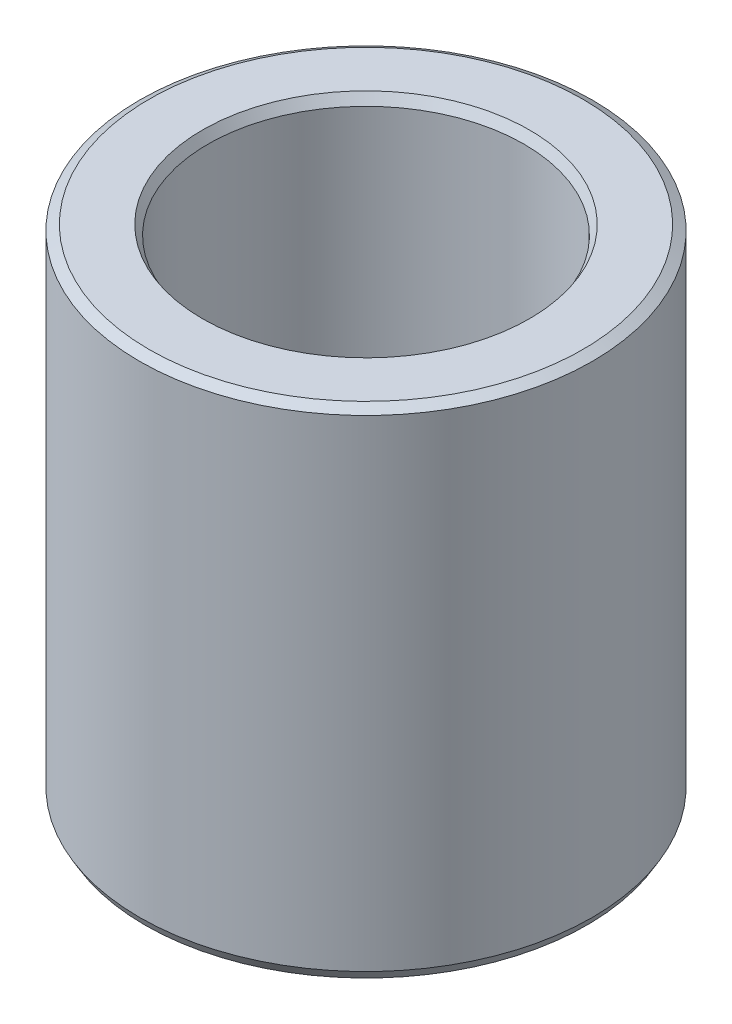
ISO-10303-21;
HEADER;
FILE_DESCRIPTION(('STEP AP214'),'2;1');
FILE_NAME('part.step','',(''),(''),'','','');
FILE_SCHEMA(('AUTOMOTIVE_DESIGN { 1 0 10303 214 1 1 1 1 }'));
ENDSEC;
DATA;
#1=APPLICATION_CONTEXT('core data for automotive mechanical design processes');
#2=APPLICATION_PROTOCOL_DEFINITION('international standard','automotive_design',2000,#1);
#3=PRODUCT_CONTEXT('',#1,'mechanical');
#4=PRODUCT('Part','Part','',(#3));
#5=PRODUCT_RELATED_PRODUCT_CATEGORY('part','',(#4));
#6=PRODUCT_DEFINITION_FORMATION('','',#4);
#7=PRODUCT_DEFINITION_CONTEXT('part definition',#1,'design');
#8=PRODUCT_DEFINITION('design','',#6,#7);
#9=PRODUCT_DEFINITION_SHAPE('','',#8);
#10=(LENGTH_UNIT() NAMED_UNIT(*) SI_UNIT(.MILLI.,.METRE.));
#11=(NAMED_UNIT(*) PLANE_ANGLE_UNIT() SI_UNIT($,.RADIAN.));
#12=(NAMED_UNIT(*) SI_UNIT($,.STERADIAN.) SOLID_ANGLE_UNIT());
#13=UNCERTAINTY_MEASURE_WITH_UNIT(LENGTH_MEASURE(1.E-05),#10,'distance_accuracy_value','');
#14=(GEOMETRIC_REPRESENTATION_CONTEXT(3) GLOBAL_UNCERTAINTY_ASSIGNED_CONTEXT((#13)) GLOBAL_UNIT_ASSIGNED_CONTEXT((#10,
#11,#12)) REPRESENTATION_CONTEXT('',''));
#15=CARTESIAN_POINT('',(0.,0.,0.));
#16=DIRECTION('',(0.,0.,1.));
#17=DIRECTION('',(1.,0.,0.));
#18=AXIS2_PLACEMENT_3D('',#15,#16,#17);
#19=CARTESIAN_POINT('',(0.,76.783560247809,0.));
#20=DIRECTION('',(0.,-1.,0.));
#21=DIRECTION('',(0.,0.,-1.));
#22=AXIS2_PLACEMENT_3D('',#19,#20,#21);
#23=CYLINDRICAL_SURFACE('',#22,35.);
#24=CARTESIAN_POINT('',(0.,1.47104861356911,0.));
#25=DIRECTION('',(0.,1.,0.));
#26=DIRECTION('',(0.,0.,1.));
#27=AXIS2_PLACEMENT_3D('',#24,#25,#26);
#28=CIRCLE('',#27,35.);
#29=CARTESIAN_POINT('',(0.,1.47104861356911,35.));
#30=VERTEX_POINT('',#29);
#31=EDGE_CURVE('E10',#30,#30,#28,.T.);
#32=ORIENTED_EDGE('',*,*,#31,.T.);
#33=EDGE_LOOP('',(#32));
#34=FACE_BOUND('',#33,.T.);
#35=CARTESIAN_POINT('',(0.,75.9342499347738,0.));
#36=DIRECTION('',(0.,1.,0.));
#37=DIRECTION('',(0.,0.,1.));
#38=AXIS2_PLACEMENT_3D('',#35,#36,#37);
#39=CIRCLE('',#38,35.);
#40=CARTESIAN_POINT('',(0.,75.9342499347738,-35.));
#41=VERTEX_POINT('',#40);
#42=EDGE_CURVE('E50',#41,#41,#39,.F.);
#43=ORIENTED_EDGE('',*,*,#42,.T.);
#44=EDGE_LOOP('',(#43));
#45=FACE_BOUND('',#44,.T.);
#46=ADVANCED_FACE('F39',(#34,#45),#23,.T.);
#47=CARTESIAN_POINT('',(0.,76.783560247809,0.));
#48=DIRECTION('',(0.,1.,0.));
#49=DIRECTION('',(0.,0.,1.));
#50=AXIS2_PLACEMENT_3D('',#47,#48,#49);
#51=PLANE('',#50);
#52=CARTESIAN_POINT('',(0.,76.783560247809,0.));
#53=DIRECTION('',(0.,1.,0.));
#54=DIRECTION('',(0.,0.,1.));
#55=AXIS2_PLACEMENT_3D('',#52,#53,#54);
#56=CIRCLE('',#55,25.2855158450938);
#57=CARTESIAN_POINT('',(0.,76.783560247809,25.2855158450938));
#58=VERTEX_POINT('',#57);
#59=EDGE_CURVE('E58',#58,#58,#56,.F.);
#60=ORIENTED_EDGE('',*,*,#59,.T.);
#61=EDGE_LOOP('',(#60));
#62=FACE_BOUND('',#61,.T.);
#63=CARTESIAN_POINT('',(0.,76.783560247809,0.));
#64=DIRECTION('',(0.,1.,0.));
#65=DIRECTION('',(0.,0.,1.));
#66=AXIS2_PLACEMENT_3D('',#63,#64,#65);
#67=CIRCLE('',#66,33.5289513864309);
#68=CARTESIAN_POINT('',(0.,76.7835602478089,-33.5289513864309));
#69=VERTEX_POINT('',#68);
#70=EDGE_CURVE('E61',#69,#69,#67,.T.);
#71=ORIENTED_EDGE('',*,*,#70,.T.);
#72=EDGE_LOOP('',(#71));
#73=FACE_BOUND('',#72,.T.);
#74=ADVANCED_FACE('F88',(#62,#73),#51,.T.);
#75=CARTESIAN_POINT('',(0.,0.,0.));
#76=DIRECTION('',(0.,1.,0.));
#77=DIRECTION('',(0.,0.,1.));
#78=AXIS2_PLACEMENT_3D('',#75,#76,#77);
#79=PLANE('',#78);
#80=CARTESIAN_POINT('',(0.,0.,0.));
#81=DIRECTION('',(0.,1.,0.));
#82=DIRECTION('',(0.,0.,1.));
#83=AXIS2_PLACEMENT_3D('',#80,#81,#82);
#84=CIRCLE('',#83,25.9072541456277);
#85=CARTESIAN_POINT('',(0.,0.,-25.9072541456277));
#86=VERTEX_POINT('',#85);
#87=EDGE_CURVE('E51',#86,#86,#84,.T.);
#88=ORIENTED_EDGE('',*,*,#87,.T.);
#89=EDGE_LOOP('',(#88));
#90=FACE_BOUND('',#89,.T.);
#91=CARTESIAN_POINT('',(0.,0.,0.));
#92=DIRECTION('',(0.,1.,0.));
#93=DIRECTION('',(0.,0.,1.));
#94=AXIS2_PLACEMENT_3D('',#91,#92,#93);
#95=CIRCLE('',#94,34.1506896869649);
#96=CARTESIAN_POINT('',(0.,0.,34.1506896869649));
#97=VERTEX_POINT('',#96);
#98=EDGE_CURVE('E54',#97,#97,#95,.F.);
#99=ORIENTED_EDGE('',*,*,#98,.T.);
#100=EDGE_LOOP('',(#99));
#101=FACE_BOUND('',#100,.T.);
#102=ADVANCED_FACE('F83',(#90,#101),#79,.F.);
#103=CARTESIAN_POINT('',(0.,76.783560247809,0.));
#104=DIRECTION('',(0.,-1.,0.));
#105=DIRECTION('',(0.,0.,-1.));
#106=AXIS2_PLACEMENT_3D('',#103,#104,#105);
#107=CYLINDRICAL_SURFACE('',#106,24.4362055320586);
#108=CARTESIAN_POINT('',(0.,75.3125116342398,0.));
#109=DIRECTION('',(0.,1.,0.));
#110=DIRECTION('',(0.,0.,1.));
#111=AXIS2_PLACEMENT_3D('',#108,#109,#110);
#112=CIRCLE('',#111,24.4362055320586);
#113=CARTESIAN_POINT('',(0.,75.3125116342398,24.4362055320586));
#114=VERTEX_POINT('',#113);
#115=EDGE_CURVE('E67',#114,#114,#112,.T.);
#116=ORIENTED_EDGE('',*,*,#115,.T.);
#117=EDGE_LOOP('',(#116));
#118=FACE_BOUND('',#117,.T.);
#119=CARTESIAN_POINT('',(0.,0.849310313035173,0.));
#120=DIRECTION('',(0.,1.,0.));
#121=DIRECTION('',(0.,0.,1.));
#122=AXIS2_PLACEMENT_3D('',#119,#120,#121);
#123=CIRCLE('',#122,24.4362055320586);
#124=CARTESIAN_POINT('',(0.,0.849310313035173,-24.4362055320586));
#125=VERTEX_POINT('',#124);
#126=EDGE_CURVE('E69',#125,#125,#123,.F.);
#127=ORIENTED_EDGE('',*,*,#126,.T.);
#128=EDGE_LOOP('',(#127));
#129=FACE_BOUND('',#128,.T.);
#130=ADVANCED_FACE('F71',(#118,#129),#107,.F.);
#131=CARTESIAN_POINT('',(0.,75.3125116342398,0.));
#132=DIRECTION('',(0.,1.,0.));
#133=DIRECTION('',(0.,0.,1.));
#134=AXIS2_PLACEMENT_3D('',#131,#132,#133);
#135=CONICAL_SURFACE('',#134,24.4362055320586,0.523598775598292);
#136=ORIENTED_EDGE('',*,*,#59,.F.);
#137=EDGE_LOOP('',(#136));
#138=FACE_BOUND('',#137,.T.);
#139=ORIENTED_EDGE('',*,*,#115,.F.);
#140=EDGE_LOOP('',(#139));
#141=FACE_BOUND('',#140,.T.);
#142=ADVANCED_FACE('F77',(#138,#141),#135,.F.);
#143=CARTESIAN_POINT('',(0.,0.,0.));
#144=DIRECTION('',(0.,-1.,0.));
#145=DIRECTION('',(0.,0.,-1.));
#146=AXIS2_PLACEMENT_3D('',#143,#144,#145);
#147=CONICAL_SURFACE('',#146,25.9072541456277,1.04719755119659);
#148=CARTESIAN_POINT('',(0.,0.849310313035173,-24.4362055320586));
#149=CARTESIAN_POINT('',(0.,0.840463330607724,-24.4515289551166));
#150=CARTESIAN_POINT('',(0.,0.831616348180274,-24.4668523781747));
#151=CARTESIAN_POINT('',(0.,0.813922383325374,-24.4974992242907));
#152=CARTESIAN_POINT('',(0.,0.805075400897924,-24.5128226473487));
#153=CARTESIAN_POINT('',(0.,0.787381436043025,-24.5434694934647));
#154=CARTESIAN_POINT('',(0.,0.778534453615575,-24.5587929165227));
#155=CARTESIAN_POINT('',(0.,0.760840488760676,-24.5894397626387));
#156=CARTESIAN_POINT('',(0.,0.751993506333226,-24.6047631856968));
#157=CARTESIAN_POINT('',(0.,0.734299541478326,-24.6354100318128));
#158=CARTESIAN_POINT('',(0.,0.725452559050877,-24.6507334548708));
#159=CARTESIAN_POINT('',(0.,0.707758594195978,-24.6813803009868));
#160=CARTESIAN_POINT('',(0.,0.698911611768528,-24.6967037240448));
#161=CARTESIAN_POINT('',(0.,0.681217646913628,-24.7273505701609));
#162=CARTESIAN_POINT('',(0.,0.672370664486179,-24.7426739932189));
#163=CARTESIAN_POINT('',(0.,0.654676699631279,-24.7733208393349));
#164=CARTESIAN_POINT('',(0.,0.645829717203829,-24.7886442623929));
#165=CARTESIAN_POINT('',(0.,0.62813575234893,-24.8192911085089));
#166=CARTESIAN_POINT('',(0.,0.61928876992148,-24.8346145315669));
#167=CARTESIAN_POINT('',(0.,0.601594805066581,-24.865261377683));
#168=CARTESIAN_POINT('',(0.,0.592747822639132,-24.880584800741));
#169=CARTESIAN_POINT('',(0.,0.575053857784232,-24.911231646857));
#170=CARTESIAN_POINT('',(0.,0.566206875356782,-24.926555069915));
#171=CARTESIAN_POINT('',(0.,0.548512910501882,-24.957201916031));
#172=CARTESIAN_POINT('',(0.,0.539665928074433,-24.972525339089));
#173=CARTESIAN_POINT('',(0.,0.521971963219534,-25.0031721852051));
#174=CARTESIAN_POINT('',(0.,0.513124980792083,-25.0184956082631));
#175=CARTESIAN_POINT('',(0.,0.495431015937184,-25.0491424543791));
#176=CARTESIAN_POINT('',(0.,0.486584033509735,-25.0644658774371));
#177=CARTESIAN_POINT('',(0.,0.468890068654835,-25.0951127235531));
#178=CARTESIAN_POINT('',(0.,0.460043086227385,-25.1104361466111));
#179=CARTESIAN_POINT('',(0.,0.442349121372486,-25.1410829927272));
#180=CARTESIAN_POINT('',(0.,0.433502138945036,-25.1564064157852));
#181=CARTESIAN_POINT('',(0.,0.415808174090137,-25.1870532619012));
#182=CARTESIAN_POINT('',(0.,0.406961191662687,-25.2023766849592));
#183=CARTESIAN_POINT('',(0.,0.389267226807788,-25.2330235310752));
#184=CARTESIAN_POINT('',(0.,0.380420244380338,-25.2483469541333));
#185=CARTESIAN_POINT('',(0.,0.362726279525438,-25.2789938002493));
#186=CARTESIAN_POINT('',(0.,0.353879297097989,-25.2943172233073));
#187=CARTESIAN_POINT('',(0.,0.33618533224309,-25.3249640694233));
#188=CARTESIAN_POINT('',(0.,0.327338349815639,-25.3402874924813));
#189=CARTESIAN_POINT('',(0.,0.30964438496074,-25.3709343385973));
#190=CARTESIAN_POINT('',(0.,0.300797402533291,-25.3862577616554));
#191=CARTESIAN_POINT('',(0.,0.283103437678391,-25.4169046077714));
#192=CARTESIAN_POINT('',(0.,0.274256455250941,-25.4322280308294));
#193=CARTESIAN_POINT('',(0.,0.256562490396042,-25.4628748769454));
#194=CARTESIAN_POINT('',(0.,0.247715507968592,-25.4781983000034));
#195=CARTESIAN_POINT('',(0.,0.230021543113693,-25.5088451461194));
#196=CARTESIAN_POINT('',(0.,0.221174560686243,-25.5241685691775));
#197=CARTESIAN_POINT('',(0.,0.203480595831343,-25.5548154152935));
#198=CARTESIAN_POINT('',(0.,0.194633613403894,-25.5701388383515));
#199=CARTESIAN_POINT('',(0.,0.176939648548995,-25.6007856844675));
#200=CARTESIAN_POINT('',(0.,0.168092666121545,-25.6161091075255));
#201=CARTESIAN_POINT('',(0.,0.150398701266645,-25.6467559536416));
#202=CARTESIAN_POINT('',(0.,0.141551718839195,-25.6620793766996));
#203=CARTESIAN_POINT('',(0.,0.123857753984296,-25.6927262228156));
#204=CARTESIAN_POINT('',(0.,0.115010771556847,-25.7080496458736));
#205=CARTESIAN_POINT('',(0.,0.0973168067019472,-25.7386964919896));
#206=CARTESIAN_POINT('',(0.,0.088469824274497,-25.7540199150476));
#207=CARTESIAN_POINT('',(0.,0.0707758594195975,-25.7846667611637));
#208=CARTESIAN_POINT('',(0.,0.0619288769921482,-25.7999901842217));
#209=CARTESIAN_POINT('',(0.,0.0442349121372489,-25.8306370303377));
#210=CARTESIAN_POINT('',(0.,0.0353879297097989,-25.8459604533957));
#211=CARTESIAN_POINT('',(0.,0.0176939648548989,-25.8766072995117));
#212=CARTESIAN_POINT('',(0.,0.00884698242744889,-25.8919307225697));
#213=CARTESIAN_POINT('',(0.,0.,-25.9072541456277));
#214=B_SPLINE_CURVE_WITH_KNOTS('',3,(#148,#149,#150,#151,#152,#153,#154,#155,#156,#157,#158,
#159,#160,#161,#162,#163,#164,#165,#166,#167,#168,#169,#170,#171,#172,#173,#174,#175,#176,#177,
#178,#179,#180,#181,#182,#183,#184,#185,#186,#187,#188,#189,#190,#191,#192,#193,#194,#195,#196,
#197,#198,#199,#200,#201,#202,#203,#204,#205,#206,#207,#208,#209,#210,#211,#212,#213),
.UNSPECIFIED.,.F.,.F.,(4,2,2,2,2,2,2,2,2,2,2,2,2,2,2,2,2,2,2,2,2,2,2,2,2,2,2,2,2,2,2,2,4),(0.,
0.0530818945646989,0.106163789129395,0.159245683694094,0.21232757825879,0.265409472823489,
0.318491367388185,0.371573261952883,0.424655156517579,0.477737051082278,0.530818945646977,
0.583900840211673,0.636982734776372,0.690064629341068,0.743146523905767,0.796228418470463,
0.849310313035162,0.902392207599861,0.955474102164557,1.00855599672926,1.06163789129395,
1.11471978585865,1.16780168042335,1.22088357498805,1.27396546955274,1.32704736411744,
1.38012925868214,1.43321115324684,1.48629304781153,1.53937494237623,1.59245683694093,
1.64553873150563,1.69862062607032),.UNSPECIFIED.);
#215=EDGE_CURVE('BSEAM73',#125,#86,#214,.T.);
#216=ORIENTED_EDGE('',*,*,#126,.F.);
#217=ORIENTED_EDGE('',*,*,#87,.F.);
#218=ORIENTED_EDGE('',*,*,#215,.T.);
#219=ORIENTED_EDGE('',*,*,#215,.F.);
#220=EDGE_LOOP('',(#216,#218,#217,#219));
#221=FACE_BOUND('',#220,.T.);
#222=ADVANCED_FACE('F73',(#221),#147,.F.);
#223=CARTESIAN_POINT('',(0.,1.47104861356911,0.));
#224=DIRECTION('',(0.,1.,0.));
#225=DIRECTION('',(0.,0.,1.));
#226=AXIS2_PLACEMENT_3D('',#223,#224,#225);
#227=CONICAL_SURFACE('',#226,35.,0.523598775598301);
#228=ORIENTED_EDGE('',*,*,#98,.F.);
#229=EDGE_LOOP('',(#228));
#230=FACE_BOUND('',#229,.T.);
#231=ORIENTED_EDGE('',*,*,#31,.F.);
#232=EDGE_LOOP('',(#231));
#233=FACE_BOUND('',#232,.T.);
#234=ADVANCED_FACE('F76',(#230,#233),#227,.T.);
#235=CARTESIAN_POINT('',(0.,76.783560247809,0.));
#236=DIRECTION('',(0.,-1.,0.));
#237=DIRECTION('',(0.,0.,-1.));
#238=AXIS2_PLACEMENT_3D('',#235,#236,#237);
#239=CONICAL_SURFACE('',#238,33.5289513864309,1.0471975511966);
#240=CARTESIAN_POINT('',(0.,75.9342499347738,-35.));
#241=CARTESIAN_POINT('',(0.,75.9430969172012,-34.984676576942));
#242=CARTESIAN_POINT('',(0.,75.9519438996287,-34.969353153884));
#243=CARTESIAN_POINT('',(0.,75.9696378644836,-34.938706307768));
#244=CARTESIAN_POINT('',(0.,75.978484846911,-34.92338288471));
#245=CARTESIAN_POINT('',(0.,75.9961788117659,-34.8927360385939));
#246=CARTESIAN_POINT('',(0.,76.0050257941934,-34.8774126155359));
#247=CARTESIAN_POINT('',(0.,76.0227197590483,-34.8467657694199));
#248=CARTESIAN_POINT('',(0.,76.0315667414757,-34.8314423463619));
#249=CARTESIAN_POINT('',(0.,76.0492607063306,-34.8007955002459));
#250=CARTESIAN_POINT('',(0.,76.0581076887581,-34.7854720771878));
#251=CARTESIAN_POINT('',(0.,76.075801653613,-34.7548252310718));
#252=CARTESIAN_POINT('',(0.,76.0846486360404,-34.7395018080138));
#253=CARTESIAN_POINT('',(0.,76.1023426008953,-34.7088549618978));
#254=CARTESIAN_POINT('',(0.,76.1111895833228,-34.6935315388398));
#255=CARTESIAN_POINT('',(0.,76.1288835481777,-34.6628846927238));
#256=CARTESIAN_POINT('',(0.,76.1377305306051,-34.6475612696658));
#257=CARTESIAN_POINT('',(0.,76.15542449546,-34.6169144235497));
#258=CARTESIAN_POINT('',(0.,76.1642714778875,-34.6015910004917));
#259=CARTESIAN_POINT('',(0.,76.1819654427424,-34.5709441543757));
#260=CARTESIAN_POINT('',(0.,76.1908124251698,-34.5556207313177));
#261=CARTESIAN_POINT('',(0.,76.2085063900247,-34.5249738852017));
#262=CARTESIAN_POINT('',(0.,76.2173533724522,-34.5096504621436));
#263=CARTESIAN_POINT('',(0.,76.2350473373071,-34.4790036160276));
#264=CARTESIAN_POINT('',(0.,76.2438943197345,-34.4636801929696));
#265=CARTESIAN_POINT('',(0.,76.2615882845894,-34.4330333468536));
#266=CARTESIAN_POINT('',(0.,76.2704352670169,-34.4177099237956));
#267=CARTESIAN_POINT('',(0.,76.2881292318718,-34.3870630776795));
#268=CARTESIAN_POINT('',(0.,76.2969762142992,-34.3717396546215));
#269=CARTESIAN_POINT('',(0.,76.3146701791541,-34.3410928085055));
#270=CARTESIAN_POINT('',(0.,76.3235171615816,-34.3257693854475));
#271=CARTESIAN_POINT('',(0.,76.3412111264365,-34.2951225393315));
#272=CARTESIAN_POINT('',(0.,76.3500581088639,-34.2797991162735));
#273=CARTESIAN_POINT('',(0.,76.3677520737188,-34.2491522701574));
#274=CARTESIAN_POINT('',(0.,76.3765990561463,-34.2338288470994));
#275=CARTESIAN_POINT('',(0.,76.3942930210012,-34.2031820009834));
#276=CARTESIAN_POINT('',(0.,76.4031400034286,-34.1878585779254));
#277=CARTESIAN_POINT('',(0.,76.4208339682835,-34.1572117318094));
#278=CARTESIAN_POINT('',(0.,76.429680950711,-34.1418883087514));
#279=CARTESIAN_POINT('',(0.,76.4473749155659,-34.1112414626353));
#280=CARTESIAN_POINT('',(0.,76.4562218979933,-34.0959180395773));
#281=CARTESIAN_POINT('',(0.,76.4739158628482,-34.0652711934613));
#282=CARTESIAN_POINT('',(0.,76.4827628452757,-34.0499477704033));
#283=CARTESIAN_POINT('',(0.,76.5004568101306,-34.0193009242873));
#284=CARTESIAN_POINT('',(0.,76.509303792558,-34.0039775012292));
#285=CARTESIAN_POINT('',(0.,76.5269977574129,-33.9733306551132));
#286=CARTESIAN_POINT('',(0.,76.5358447398404,-33.9580072320552));
#287=CARTESIAN_POINT('',(0.,76.5535387046953,-33.9273603859392));
#288=CARTESIAN_POINT('',(0.,76.5623856871227,-33.9120369628812));
#289=CARTESIAN_POINT('',(0.,76.5800796519776,-33.8813901167652));
#290=CARTESIAN_POINT('',(0.,76.5889266344051,-33.8660666937071));
#291=CARTESIAN_POINT('',(0.,76.60662059926,-33.8354198475911));
#292=CARTESIAN_POINT('',(0.,76.6154675816874,-33.8200964245331));
#293=CARTESIAN_POINT('',(0.,76.6331615465423,-33.7894495784171));
#294=CARTESIAN_POINT('',(0.,76.6420085289698,-33.7741261553591));
#295=CARTESIAN_POINT('',(0.,76.6597024938247,-33.743479309243));
#296=CARTESIAN_POINT('',(0.,76.6685494762521,-33.728155886185));
#297=CARTESIAN_POINT('',(0.,76.686243441107,-33.697509040069));
#298=CARTESIAN_POINT('',(0.,76.6950904235345,-33.682185617011));
#299=CARTESIAN_POINT('',(0.,76.7127843883894,-33.651538770895));
#300=CARTESIAN_POINT('',(0.,76.7216313708168,-33.636215347837));
#301=CARTESIAN_POINT('',(0.,76.7393253356717,-33.6055685017209));
#302=CARTESIAN_POINT('',(0.,76.7481723180992,-33.5902450786629));
#303=CARTESIAN_POINT('',(0.,76.7658662829541,-33.5595982325469));
#304=CARTESIAN_POINT('',(0.,76.7747132653815,-33.5442748094889));
#305=CARTESIAN_POINT('',(0.,76.783560247809,-33.5289513864309));
#306=B_SPLINE_CURVE_WITH_KNOTS('',3,(#240,#241,#242,#243,#244,#245,#246,#247,#248,#249,#250,
#251,#252,#253,#254,#255,#256,#257,#258,#259,#260,#261,#262,#263,#264,#265,#266,#267,#268,#269,
#270,#271,#272,#273,#274,#275,#276,#277,#278,#279,#280,#281,#282,#283,#284,#285,#286,#287,#288,
#289,#290,#291,#292,#293,#294,#295,#296,#297,#298,#299,#300,#301,#302,#303,#304,#305),
.UNSPECIFIED.,.F.,.F.,(4,2,2,2,2,2,2,2,2,2,2,2,2,2,2,2,2,2,2,2,2,2,2,2,2,2,2,2,2,2,2,2,4),(0.,
0.053081894564702,0.106163789129404,0.159245683694099,0.212327578258801,0.265409472823496,
0.318491367388198,0.371573261952893,0.424655156517589,0.477737051082291,0.530818945646986,
0.583900840211688,0.636982734776383,0.690064629341085,0.74314652390578,0.796228418470482,
0.849310313035177,0.902392207599879,0.955474102164581,1.00855599672927,1.06163789129397,
1.11471978585867,1.16780168042337,1.22088357498806,1.27396546955277,1.32704736411747,
1.38012925868216,1.43321115324687,1.48629304781156,1.53937494237626,1.59245683694095,
1.64553873150565,1.69862062607036),.UNSPECIFIED.);
#307=EDGE_CURVE('BSEAM45',#41,#69,#306,.T.);
#308=ORIENTED_EDGE('',*,*,#42,.F.);
#309=ORIENTED_EDGE('',*,*,#70,.F.);
#310=ORIENTED_EDGE('',*,*,#307,.T.);
#311=ORIENTED_EDGE('',*,*,#307,.F.);
#312=EDGE_LOOP('',(#308,#310,#309,#311));
#313=FACE_BOUND('',#312,.T.);
#314=ADVANCED_FACE('F45',(#313),#239,.T.);
#315=CLOSED_SHELL('',(#46,#74,#102,#130,#142,#222,#234,#314));
#316=MANIFOLD_SOLID_BREP('B2',#315);
#317=ADVANCED_BREP_SHAPE_REPRESENTATION('',(#18,#316),#14);
#318=SHAPE_DEFINITION_REPRESENTATION(#9,#317);
ENDSEC;
END-ISO-10303-21;
